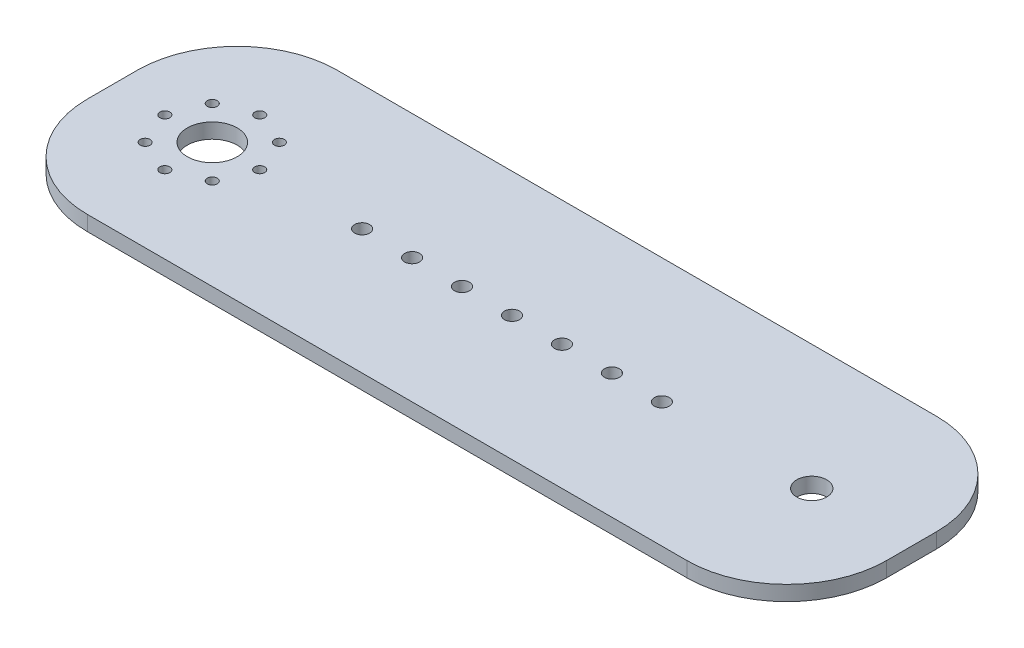
ISO-10303-21;
HEADER;
FILE_DESCRIPTION(('STEP AP214'),'2;1');
FILE_NAME('part.step','',(''),(''),'','','');
FILE_SCHEMA(('AUTOMOTIVE_DESIGN { 1 0 10303 214 1 1 1 1 }'));
ENDSEC;
DATA;
#1=APPLICATION_CONTEXT('core data for automotive mechanical design processes');
#2=APPLICATION_PROTOCOL_DEFINITION('international standard','automotive_design',2000,#1);
#3=PRODUCT_CONTEXT('',#1,'mechanical');
#4=PRODUCT('Part','Part','',(#3));
#5=PRODUCT_RELATED_PRODUCT_CATEGORY('part','',(#4));
#6=PRODUCT_DEFINITION_FORMATION('','',#4);
#7=PRODUCT_DEFINITION_CONTEXT('part definition',#1,'design');
#8=PRODUCT_DEFINITION('design','',#6,#7);
#9=PRODUCT_DEFINITION_SHAPE('','',#8);
#10=(LENGTH_UNIT() NAMED_UNIT(*) SI_UNIT(.MILLI.,.METRE.));
#11=(NAMED_UNIT(*) PLANE_ANGLE_UNIT() SI_UNIT($,.RADIAN.));
#12=(NAMED_UNIT(*) SI_UNIT($,.STERADIAN.) SOLID_ANGLE_UNIT());
#13=UNCERTAINTY_MEASURE_WITH_UNIT(LENGTH_MEASURE(1.E-05),#10,'distance_accuracy_value','');
#14=(GEOMETRIC_REPRESENTATION_CONTEXT(3) GLOBAL_UNCERTAINTY_ASSIGNED_CONTEXT((#13)) GLOBAL_UNIT_ASSIGNED_CONTEXT((#10,
#11,#12)) REPRESENTATION_CONTEXT('',''));
#15=CARTESIAN_POINT('',(0.,0.,0.));
#16=DIRECTION('',(0.,0.,1.));
#17=DIRECTION('',(1.,0.,0.));
#18=AXIS2_PLACEMENT_3D('',#15,#16,#17);
#19=CARTESIAN_POINT('',(80.,3.,-25.));
#20=DIRECTION('',(-1.,0.,0.));
#21=DIRECTION('',(0.,0.,1.));
#22=AXIS2_PLACEMENT_3D('',#19,#20,#21);
#23=PLANE('',#22);
#24=DIRECTION('',(0.,0.,-1.));
#25=VECTOR('',#24,1.);
#26=CARTESIAN_POINT('',(80.,0.,-25.));
#27=LINE('',#26,#25);
#28=CARTESIAN_POINT('',(80.,0.,5.));
#29=VERTEX_POINT('',#28);
#30=CARTESIAN_POINT('',(80.,0.,-5.));
#31=VERTEX_POINT('',#30);
#32=EDGE_CURVE('E136',#29,#31,#27,.T.);
#33=ORIENTED_EDGE('',*,*,#32,.T.);
#34=DIRECTION('',(0.,-1.,0.));
#35=VECTOR('',#34,1.);
#36=CARTESIAN_POINT('',(80.,3.,-5.));
#37=LINE('',#36,#35);
#38=CARTESIAN_POINT('',(80.,3.,-5.));
#39=VERTEX_POINT('',#38);
#40=EDGE_CURVE('E113',#31,#39,#37,.F.);
#41=ORIENTED_EDGE('',*,*,#40,.T.);
#42=DIRECTION('',(0.,0.,-1.));
#43=VECTOR('',#42,1.);
#44=CARTESIAN_POINT('',(80.,3.,-25.));
#45=LINE('',#44,#43);
#46=CARTESIAN_POINT('',(80.,3.,5.));
#47=VERTEX_POINT('',#46);
#48=EDGE_CURVE('E146',#47,#39,#45,.T.);
#49=ORIENTED_EDGE('',*,*,#48,.F.);
#50=DIRECTION('',(0.,-1.,0.));
#51=VECTOR('',#50,1.);
#52=CARTESIAN_POINT('',(80.,3.,5.));
#53=LINE('',#52,#51);
#54=EDGE_CURVE('E118',#47,#29,#53,.T.);
#55=ORIENTED_EDGE('',*,*,#54,.T.);
#56=EDGE_LOOP('',(#33,#41,#49,#55));
#57=FACE_BOUND('',#56,.T.);
#58=ADVANCED_FACE('F41',(#57),#23,.F.);
#59=CARTESIAN_POINT('',(-80.,3.,-25.));
#60=DIRECTION('',(0.,0.,1.));
#61=DIRECTION('',(1.,0.,0.));
#62=AXIS2_PLACEMENT_3D('',#59,#60,#61);
#63=PLANE('',#62);
#64=DIRECTION('',(-1.,0.,0.));
#65=VECTOR('',#64,1.);
#66=CARTESIAN_POINT('',(-80.,3.,-25.));
#67=LINE('',#66,#65);
#68=CARTESIAN_POINT('',(60.,3.,-25.));
#69=VERTEX_POINT('',#68);
#70=CARTESIAN_POINT('',(-60.,3.,-25.));
#71=VERTEX_POINT('',#70);
#72=EDGE_CURVE('E128',#69,#71,#67,.T.);
#73=ORIENTED_EDGE('',*,*,#72,.F.);
#74=DIRECTION('',(0.,-1.,0.));
#75=VECTOR('',#74,1.);
#76=CARTESIAN_POINT('',(60.,3.,-25.));
#77=LINE('',#76,#75);
#78=CARTESIAN_POINT('',(60.,0.,-25.));
#79=VERTEX_POINT('',#78);
#80=EDGE_CURVE('E112',#69,#79,#77,.T.);
#81=ORIENTED_EDGE('',*,*,#80,.T.);
#82=DIRECTION('',(-1.,0.,0.));
#83=VECTOR('',#82,1.);
#84=CARTESIAN_POINT('',(-80.,0.,-25.));
#85=LINE('',#84,#83);
#86=CARTESIAN_POINT('',(-60.,0.,-25.));
#87=VERTEX_POINT('',#86);
#88=EDGE_CURVE('E125',#79,#87,#85,.T.);
#89=ORIENTED_EDGE('',*,*,#88,.T.);
#90=DIRECTION('',(0.,-1.,0.));
#91=VECTOR('',#90,1.);
#92=CARTESIAN_POINT('',(-60.,3.,-25.));
#93=LINE('',#92,#91);
#94=EDGE_CURVE('E130',#87,#71,#93,.F.);
#95=ORIENTED_EDGE('',*,*,#94,.T.);
#96=EDGE_LOOP('',(#73,#81,#89,#95));
#97=FACE_BOUND('',#96,.T.);
#98=ADVANCED_FACE('F124',(#97),#63,.F.);
#99=CARTESIAN_POINT('',(-80.,3.,-25.));
#100=DIRECTION('',(1.,0.,0.));
#101=DIRECTION('',(0.,0.,-1.));
#102=AXIS2_PLACEMENT_3D('',#99,#100,#101);
#103=PLANE('',#102);
#104=DIRECTION('',(0.,0.,1.));
#105=VECTOR('',#104,1.);
#106=CARTESIAN_POINT('',(-80.,3.,-25.));
#107=LINE('',#106,#105);
#108=CARTESIAN_POINT('',(-80.,3.,-5.));
#109=VERTEX_POINT('',#108);
#110=CARTESIAN_POINT('',(-80.,3.,5.));
#111=VERTEX_POINT('',#110);
#112=EDGE_CURVE('E169',#109,#111,#107,.T.);
#113=ORIENTED_EDGE('',*,*,#112,.F.);
#114=DIRECTION('',(0.,-1.,0.));
#115=VECTOR('',#114,1.);
#116=CARTESIAN_POINT('',(-80.,3.,-5.));
#117=LINE('',#116,#115);
#118=CARTESIAN_POINT('',(-80.,0.,-5.));
#119=VERTEX_POINT('',#118);
#120=EDGE_CURVE('E11',#109,#119,#117,.T.);
#121=ORIENTED_EDGE('',*,*,#120,.T.);
#122=DIRECTION('',(0.,0.,1.));
#123=VECTOR('',#122,1.);
#124=CARTESIAN_POINT('',(-80.,0.,-25.));
#125=LINE('',#124,#123);
#126=CARTESIAN_POINT('',(-80.,0.,5.));
#127=VERTEX_POINT('',#126);
#128=EDGE_CURVE('E135',#119,#127,#125,.T.);
#129=ORIENTED_EDGE('',*,*,#128,.T.);
#130=DIRECTION('',(0.,-1.,0.));
#131=VECTOR('',#130,1.);
#132=CARTESIAN_POINT('',(-80.,3.,5.));
#133=LINE('',#132,#131);
#134=EDGE_CURVE('E49',#127,#111,#133,.F.);
#135=ORIENTED_EDGE('',*,*,#134,.T.);
#136=EDGE_LOOP('',(#113,#121,#129,#135));
#137=FACE_BOUND('',#136,.T.);
#138=ADVANCED_FACE('F168',(#137),#103,.F.);
#139=CARTESIAN_POINT('',(-80.,3.,25.));
#140=DIRECTION('',(0.,0.,-1.));
#141=DIRECTION('',(-1.,0.,0.));
#142=AXIS2_PLACEMENT_3D('',#139,#140,#141);
#143=PLANE('',#142);
#144=DIRECTION('',(1.,0.,0.));
#145=VECTOR('',#144,1.);
#146=CARTESIAN_POINT('',(-80.,0.,25.));
#147=LINE('',#146,#145);
#148=CARTESIAN_POINT('',(-60.,0.,25.));
#149=VERTEX_POINT('',#148);
#150=CARTESIAN_POINT('',(60.,0.,25.));
#151=VERTEX_POINT('',#150);
#152=EDGE_CURVE('E139',#149,#151,#147,.T.);
#153=ORIENTED_EDGE('',*,*,#152,.T.);
#154=DIRECTION('',(0.,-1.,0.));
#155=VECTOR('',#154,1.);
#156=CARTESIAN_POINT('',(60.,3.,25.));
#157=LINE('',#156,#155);
#158=CARTESIAN_POINT('',(60.,3.,25.));
#159=VERTEX_POINT('',#158);
#160=EDGE_CURVE('E56',#151,#159,#157,.F.);
#161=ORIENTED_EDGE('',*,*,#160,.T.);
#162=DIRECTION('',(1.,0.,0.));
#163=VECTOR('',#162,1.);
#164=CARTESIAN_POINT('',(-80.,3.,25.));
#165=LINE('',#164,#163);
#166=CARTESIAN_POINT('',(-60.,3.,25.));
#167=VERTEX_POINT('',#166);
#168=EDGE_CURVE('E147',#167,#159,#165,.T.);
#169=ORIENTED_EDGE('',*,*,#168,.F.);
#170=DIRECTION('',(0.,-1.,0.));
#171=VECTOR('',#170,1.);
#172=CARTESIAN_POINT('',(-60.,3.,25.));
#173=LINE('',#172,#171);
#174=EDGE_CURVE('E162',#167,#149,#173,.T.);
#175=ORIENTED_EDGE('',*,*,#174,.T.);
#176=EDGE_LOOP('',(#153,#161,#169,#175));
#177=FACE_BOUND('',#176,.T.);
#178=ADVANCED_FACE('F178',(#177),#143,.F.);
#179=CARTESIAN_POINT('',(0.,3.,0.));
#180=DIRECTION('',(0.,1.,0.));
#181=DIRECTION('',(0.,0.,1.));
#182=AXIS2_PLACEMENT_3D('',#179,#180,#181);
#183=PLANE('',#182);
#184=CARTESIAN_POINT('',(-30.,3.,0.));
#185=DIRECTION('',(0.,1.,0.));
#186=DIRECTION('',(0.,0.,1.));
#187=AXIS2_PLACEMENT_3D('',#184,#185,#186);
#188=CIRCLE('',#187,1.5);
#189=CARTESIAN_POINT('',(-30.,3.,1.5));
#190=VERTEX_POINT('',#189);
#191=EDGE_CURVE('E260',#190,#190,#188,.T.);
#192=ORIENTED_EDGE('',*,*,#191,.F.);
#193=EDGE_LOOP('',(#192));
#194=FACE_BOUND('',#193,.T.);
#195=CARTESIAN_POINT('',(-20.,3.,0.));
#196=DIRECTION('',(0.,1.,0.));
#197=DIRECTION('',(0.,0.,1.));
#198=AXIS2_PLACEMENT_3D('',#195,#196,#197);
#199=CIRCLE('',#198,1.5);
#200=CARTESIAN_POINT('',(-20.,3.,1.5));
#201=VERTEX_POINT('',#200);
#202=EDGE_CURVE('E267',#201,#201,#199,.T.);
#203=ORIENTED_EDGE('',*,*,#202,.F.);
#204=EDGE_LOOP('',(#203));
#205=FACE_BOUND('',#204,.T.);
#206=CARTESIAN_POINT('',(-10.,3.,0.));
#207=DIRECTION('',(0.,1.,0.));
#208=DIRECTION('',(0.,0.,1.));
#209=AXIS2_PLACEMENT_3D('',#206,#207,#208);
#210=CIRCLE('',#209,1.5);
#211=CARTESIAN_POINT('',(-10.,3.,1.5));
#212=VERTEX_POINT('',#211);
#213=EDGE_CURVE('E273',#212,#212,#210,.T.);
#214=ORIENTED_EDGE('',*,*,#213,.F.);
#215=EDGE_LOOP('',(#214));
#216=FACE_BOUND('',#215,.T.);
#217=CARTESIAN_POINT('',(30.,3.,0.));
#218=DIRECTION('',(0.,1.,0.));
#219=DIRECTION('',(0.,0.,1.));
#220=AXIS2_PLACEMENT_3D('',#217,#218,#219);
#221=CIRCLE('',#220,1.5);
#222=CARTESIAN_POINT('',(30.,3.,1.5));
#223=VERTEX_POINT('',#222);
#224=EDGE_CURVE('E279',#223,#223,#221,.T.);
#225=ORIENTED_EDGE('',*,*,#224,.F.);
#226=EDGE_LOOP('',(#225));
#227=FACE_BOUND('',#226,.T.);
#228=CARTESIAN_POINT('',(20.,3.,0.));
#229=DIRECTION('',(0.,1.,0.));
#230=DIRECTION('',(0.,0.,1.));
#231=AXIS2_PLACEMENT_3D('',#228,#229,#230);
#232=CIRCLE('',#231,1.5);
#233=CARTESIAN_POINT('',(20.,3.,1.5));
#234=VERTEX_POINT('',#233);
#235=EDGE_CURVE('E259',#234,#234,#232,.T.);
#236=ORIENTED_EDGE('',*,*,#235,.F.);
#237=EDGE_LOOP('',(#236));
#238=FACE_BOUND('',#237,.T.);
#239=CARTESIAN_POINT('',(10.,3.,0.));
#240=DIRECTION('',(0.,1.,0.));
#241=DIRECTION('',(0.,0.,1.));
#242=AXIS2_PLACEMENT_3D('',#239,#240,#241);
#243=CIRCLE('',#242,1.5);
#244=CARTESIAN_POINT('',(10.,3.,1.5));
#245=VERTEX_POINT('',#244);
#246=EDGE_CURVE('E251',#245,#245,#243,.T.);
#247=ORIENTED_EDGE('',*,*,#246,.F.);
#248=EDGE_LOOP('',(#247));
#249=FACE_BOUND('',#248,.T.);
#250=CARTESIAN_POINT('',(0.,3.,0.));
#251=DIRECTION('',(0.,1.,0.));
#252=DIRECTION('',(0.,0.,1.));
#253=AXIS2_PLACEMENT_3D('',#250,#251,#252);
#254=CIRCLE('',#253,1.5);
#255=CARTESIAN_POINT('',(0.,3.,1.5));
#256=VERTEX_POINT('',#255);
#257=EDGE_CURVE('E248',#256,#256,#254,.T.);
#258=ORIENTED_EDGE('',*,*,#257,.F.);
#259=EDGE_LOOP('',(#258));
#260=FACE_BOUND('',#259,.T.);
#261=CARTESIAN_POINT('',(60.,3.,0.));
#262=DIRECTION('',(0.,1.,0.));
#263=DIRECTION('',(0.,0.,1.));
#264=AXIS2_PLACEMENT_3D('',#261,#262,#263);
#265=CIRCLE('',#264,3.00000000000001);
#266=CARTESIAN_POINT('',(60.,3.,3.00000000000001));
#267=VERTEX_POINT('',#266);
#268=EDGE_CURVE('E242',#267,#267,#265,.T.);
#269=ORIENTED_EDGE('',*,*,#268,.F.);
#270=EDGE_LOOP('',(#269));
#271=FACE_BOUND('',#270,.T.);
#272=CARTESIAN_POINT('',(-60.,3.,-9.5));
#273=DIRECTION('',(0.,1.,0.));
#274=DIRECTION('',(1.,0.,0.));
#275=AXIS2_PLACEMENT_3D('',#272,#273,#274);
#276=CIRCLE('',#275,0.999999999999998);
#277=CARTESIAN_POINT('',(-59.,3.,-9.50000000000001));
#278=VERTEX_POINT('',#277);
#279=EDGE_CURVE('E225',#278,#278,#276,.T.);
#280=ORIENTED_EDGE('',*,*,#279,.F.);
#281=EDGE_LOOP('',(#280));
#282=FACE_BOUND('',#281,.T.);
#283=CARTESIAN_POINT('',(-66.7175144212722,3.,-6.71751442127217));
#284=DIRECTION('',(0.,1.,0.));
#285=DIRECTION('',(0.707106781186544,0.,-0.707106781186551));
#286=AXIS2_PLACEMENT_3D('',#283,#284,#285);
#287=CIRCLE('',#286,0.999999999999998);
#288=CARTESIAN_POINT('',(-66.0104076400857,3.,-7.42462120245872));
#289=VERTEX_POINT('',#288);
#290=EDGE_CURVE('E219',#289,#289,#287,.T.);
#291=ORIENTED_EDGE('',*,*,#290,.F.);
#292=EDGE_LOOP('',(#291));
#293=FACE_BOUND('',#292,.T.);
#294=CARTESIAN_POINT('',(-69.5,3.,0.));
#295=DIRECTION('',(0.,1.,0.));
#296=DIRECTION('',(0.,0.,-1.));
#297=AXIS2_PLACEMENT_3D('',#294,#295,#296);
#298=CIRCLE('',#297,0.999999999999998);
#299=CARTESIAN_POINT('',(-69.5,3.,-0.999999999999998));
#300=VERTEX_POINT('',#299);
#301=EDGE_CURVE('E213',#300,#300,#298,.T.);
#302=ORIENTED_EDGE('',*,*,#301,.F.);
#303=EDGE_LOOP('',(#302));
#304=FACE_BOUND('',#303,.T.);
#305=CARTESIAN_POINT('',(-66.7175144212722,3.,6.71751442127226));
#306=DIRECTION('',(0.,1.,0.));
#307=DIRECTION('',(-0.707106781186554,0.,-0.707106781186541));
#308=AXIS2_PLACEMENT_3D('',#305,#306,#307);
#309=CIRCLE('',#308,0.999999999999998);
#310=CARTESIAN_POINT('',(-67.4246212024587,3.,6.01040764008572));
#311=VERTEX_POINT('',#310);
#312=EDGE_CURVE('E206',#311,#311,#309,.T.);
#313=ORIENTED_EDGE('',*,*,#312,.F.);
#314=EDGE_LOOP('',(#313));
#315=FACE_BOUND('',#314,.T.);
#316=CARTESIAN_POINT('',(-59.9999999999999,3.,9.5));
#317=DIRECTION('',(0.,1.,0.));
#318=DIRECTION('',(-1.,0.,0.));
#319=AXIS2_PLACEMENT_3D('',#316,#317,#318);
#320=CIRCLE('',#319,0.999999999999998);
#321=CARTESIAN_POINT('',(-60.9999999999999,3.,9.50000000000001));
#322=VERTEX_POINT('',#321);
#323=EDGE_CURVE('E237',#322,#322,#320,.T.);
#324=ORIENTED_EDGE('',*,*,#323,.F.);
#325=EDGE_LOOP('',(#324));
#326=FACE_BOUND('',#325,.T.);
#327=CARTESIAN_POINT('',(-53.2824855787277,3.,6.71751442127212));
#328=DIRECTION('',(0.,1.,0.));
#329=DIRECTION('',(-0.707106781186539,0.,0.707106781186556));
#330=AXIS2_PLACEMENT_3D('',#327,#328,#329);
#331=CIRCLE('',#330,0.999999999999998);
#332=CARTESIAN_POINT('',(-53.9895923599143,3.,7.42462120245867));
#333=VERTEX_POINT('',#332);
#334=EDGE_CURVE('E230',#333,#333,#331,.T.);
#335=ORIENTED_EDGE('',*,*,#334,.F.);
#336=EDGE_LOOP('',(#335));
#337=FACE_BOUND('',#336,.T.);
#338=CARTESIAN_POINT('',(-53.2824855787278,3.,-6.71751442127221));
#339=DIRECTION('',(0.,1.,0.));
#340=DIRECTION('',(0.707106781186549,0.,0.707106781186546));
#341=AXIS2_PLACEMENT_3D('',#338,#339,#340);
#342=CIRCLE('',#341,0.999999999999998);
#343=CARTESIAN_POINT('',(-52.5753787975413,3.,-6.01040764008567));
#344=VERTEX_POINT('',#343);
#345=EDGE_CURVE('E200',#344,#344,#342,.T.);
#346=ORIENTED_EDGE('',*,*,#345,.F.);
#347=EDGE_LOOP('',(#346));
#348=FACE_BOUND('',#347,.T.);
#349=CARTESIAN_POINT('',(-50.5,3.,0.));
#350=DIRECTION('',(0.,1.,0.));
#351=DIRECTION('',(0.,0.,1.));
#352=AXIS2_PLACEMENT_3D('',#349,#350,#351);
#353=CIRCLE('',#352,0.999999999999998);
#354=CARTESIAN_POINT('',(-50.5,3.,0.999999999999998));
#355=VERTEX_POINT('',#354);
#356=EDGE_CURVE('E194',#355,#355,#353,.T.);
#357=ORIENTED_EDGE('',*,*,#356,.F.);
#358=EDGE_LOOP('',(#357));
#359=FACE_BOUND('',#358,.T.);
#360=CARTESIAN_POINT('',(-60.,3.,0.));
#361=DIRECTION('',(0.,1.,0.));
#362=DIRECTION('',(0.,0.,1.));
#363=AXIS2_PLACEMENT_3D('',#360,#361,#362);
#364=CIRCLE('',#363,5.);
#365=CARTESIAN_POINT('',(-60.,3.,5.));
#366=VERTEX_POINT('',#365);
#367=EDGE_CURVE('E188',#366,#366,#364,.T.);
#368=ORIENTED_EDGE('',*,*,#367,.F.);
#369=EDGE_LOOP('',(#368));
#370=FACE_BOUND('',#369,.T.);
#371=ORIENTED_EDGE('',*,*,#48,.T.);
#372=CARTESIAN_POINT('',(60.,3.,-5.));
#373=DIRECTION('',(0.,1.,0.));
#374=DIRECTION('',(0.,0.,1.));
#375=AXIS2_PLACEMENT_3D('',#372,#373,#374);
#376=CIRCLE('',#375,20.);
#377=EDGE_CURVE('E160',#39,#69,#376,.T.);
#378=ORIENTED_EDGE('',*,*,#377,.T.);
#379=ORIENTED_EDGE('',*,*,#72,.T.);
#380=CARTESIAN_POINT('',(-60.,3.,-5.));
#381=DIRECTION('',(0.,1.,0.));
#382=DIRECTION('',(0.,0.,1.));
#383=AXIS2_PLACEMENT_3D('',#380,#381,#382);
#384=CIRCLE('',#383,20.);
#385=EDGE_CURVE('E156',#71,#109,#384,.T.);
#386=ORIENTED_EDGE('',*,*,#385,.T.);
#387=ORIENTED_EDGE('',*,*,#112,.T.);
#388=CARTESIAN_POINT('',(-60.,3.,5.));
#389=DIRECTION('',(0.,1.,0.));
#390=DIRECTION('',(0.,0.,1.));
#391=AXIS2_PLACEMENT_3D('',#388,#389,#390);
#392=CIRCLE('',#391,20.);
#393=EDGE_CURVE('E63',#111,#167,#392,.T.);
#394=ORIENTED_EDGE('',*,*,#393,.T.);
#395=ORIENTED_EDGE('',*,*,#168,.T.);
#396=CARTESIAN_POINT('',(60.,3.,5.));
#397=DIRECTION('',(0.,1.,0.));
#398=DIRECTION('',(0.,0.,1.));
#399=AXIS2_PLACEMENT_3D('',#396,#397,#398);
#400=CIRCLE('',#399,20.);
#401=EDGE_CURVE('E158',#159,#47,#400,.T.);
#402=ORIENTED_EDGE('',*,*,#401,.T.);
#403=EDGE_LOOP('',(#371,#378,#379,#386,#387,#394,#395,#402));
#404=FACE_BOUND('',#403,.T.);
#405=ADVANCED_FACE('F173',(#194,#205,#216,#227,#238,#249,#260,#271,#282,#293,#304,#315,#326,
#337,#348,#359,#370,#404),#183,.T.);
#406=CARTESIAN_POINT('',(0.,0.,0.));
#407=DIRECTION('',(0.,1.,0.));
#408=DIRECTION('',(0.,0.,1.));
#409=AXIS2_PLACEMENT_3D('',#406,#407,#408);
#410=PLANE('',#409);
#411=CARTESIAN_POINT('',(-30.,0.,0.));
#412=DIRECTION('',(0.,1.,0.));
#413=DIRECTION('',(0.,0.,1.));
#414=AXIS2_PLACEMENT_3D('',#411,#412,#413);
#415=CIRCLE('',#414,1.5);
#416=CARTESIAN_POINT('',(-30.,0.,1.5));
#417=VERTEX_POINT('',#416);
#418=EDGE_CURVE('E264',#417,#417,#415,.T.);
#419=ORIENTED_EDGE('',*,*,#418,.T.);
#420=EDGE_LOOP('',(#419));
#421=FACE_BOUND('',#420,.T.);
#422=CARTESIAN_POINT('',(-20.,0.,0.));
#423=DIRECTION('',(0.,1.,0.));
#424=DIRECTION('',(0.,0.,1.));
#425=AXIS2_PLACEMENT_3D('',#422,#423,#424);
#426=CIRCLE('',#425,1.5);
#427=CARTESIAN_POINT('',(-20.,0.,1.5));
#428=VERTEX_POINT('',#427);
#429=EDGE_CURVE('E263',#428,#428,#426,.T.);
#430=ORIENTED_EDGE('',*,*,#429,.T.);
#431=EDGE_LOOP('',(#430));
#432=FACE_BOUND('',#431,.T.);
#433=CARTESIAN_POINT('',(-10.,0.,0.));
#434=DIRECTION('',(0.,1.,0.));
#435=DIRECTION('',(0.,0.,1.));
#436=AXIS2_PLACEMENT_3D('',#433,#434,#435);
#437=CIRCLE('',#436,1.5);
#438=CARTESIAN_POINT('',(-10.,0.,1.5));
#439=VERTEX_POINT('',#438);
#440=EDGE_CURVE('E270',#439,#439,#437,.T.);
#441=ORIENTED_EDGE('',*,*,#440,.T.);
#442=EDGE_LOOP('',(#441));
#443=FACE_BOUND('',#442,.T.);
#444=CARTESIAN_POINT('',(30.,0.,0.));
#445=DIRECTION('',(0.,1.,0.));
#446=DIRECTION('',(0.,0.,1.));
#447=AXIS2_PLACEMENT_3D('',#444,#445,#446);
#448=CIRCLE('',#447,1.5);
#449=CARTESIAN_POINT('',(30.,0.,1.5));
#450=VERTEX_POINT('',#449);
#451=EDGE_CURVE('E276',#450,#450,#448,.T.);
#452=ORIENTED_EDGE('',*,*,#451,.T.);
#453=EDGE_LOOP('',(#452));
#454=FACE_BOUND('',#453,.T.);
#455=CARTESIAN_POINT('',(20.,0.,0.));
#456=DIRECTION('',(0.,1.,0.));
#457=DIRECTION('',(0.,0.,1.));
#458=AXIS2_PLACEMENT_3D('',#455,#456,#457);
#459=CIRCLE('',#458,1.5);
#460=CARTESIAN_POINT('',(20.,0.,1.5));
#461=VERTEX_POINT('',#460);
#462=EDGE_CURVE('E282',#461,#461,#459,.T.);
#463=ORIENTED_EDGE('',*,*,#462,.T.);
#464=EDGE_LOOP('',(#463));
#465=FACE_BOUND('',#464,.T.);
#466=CARTESIAN_POINT('',(10.,0.,0.));
#467=DIRECTION('',(0.,1.,0.));
#468=DIRECTION('',(0.,0.,1.));
#469=AXIS2_PLACEMENT_3D('',#466,#467,#468);
#470=CIRCLE('',#469,1.5);
#471=CARTESIAN_POINT('',(10.,0.,1.5));
#472=VERTEX_POINT('',#471);
#473=EDGE_CURVE('E256',#472,#472,#470,.T.);
#474=ORIENTED_EDGE('',*,*,#473,.T.);
#475=EDGE_LOOP('',(#474));
#476=FACE_BOUND('',#475,.T.);
#477=CARTESIAN_POINT('',(0.,0.,0.));
#478=DIRECTION('',(0.,1.,0.));
#479=DIRECTION('',(0.,0.,1.));
#480=AXIS2_PLACEMENT_3D('',#477,#478,#479);
#481=CIRCLE('',#480,1.5);
#482=CARTESIAN_POINT('',(0.,0.,1.5));
#483=VERTEX_POINT('',#482);
#484=EDGE_CURVE('E245',#483,#483,#481,.T.);
#485=ORIENTED_EDGE('',*,*,#484,.T.);
#486=EDGE_LOOP('',(#485));
#487=FACE_BOUND('',#486,.T.);
#488=CARTESIAN_POINT('',(60.,0.,0.));
#489=DIRECTION('',(0.,1.,0.));
#490=DIRECTION('',(0.,0.,1.));
#491=AXIS2_PLACEMENT_3D('',#488,#489,#490);
#492=CIRCLE('',#491,3.00000000000001);
#493=CARTESIAN_POINT('',(60.,0.,3.00000000000001));
#494=VERTEX_POINT('',#493);
#495=EDGE_CURVE('E234',#494,#494,#492,.T.);
#496=ORIENTED_EDGE('',*,*,#495,.T.);
#497=EDGE_LOOP('',(#496));
#498=FACE_BOUND('',#497,.T.);
#499=CARTESIAN_POINT('',(-60.,0.,-9.5));
#500=DIRECTION('',(0.,1.,0.));
#501=DIRECTION('',(1.,0.,0.));
#502=AXIS2_PLACEMENT_3D('',#499,#500,#501);
#503=CIRCLE('',#502,0.999999999999998);
#504=CARTESIAN_POINT('',(-59.,0.,-9.50000000000001));
#505=VERTEX_POINT('',#504);
#506=EDGE_CURVE('E203',#505,#505,#503,.T.);
#507=ORIENTED_EDGE('',*,*,#506,.T.);
#508=EDGE_LOOP('',(#507));
#509=FACE_BOUND('',#508,.T.);
#510=CARTESIAN_POINT('',(-66.7175144212722,0.,-6.71751442127217));
#511=DIRECTION('',(0.,1.,0.));
#512=DIRECTION('',(0.707106781186544,0.,-0.707106781186551));
#513=AXIS2_PLACEMENT_3D('',#510,#511,#512);
#514=CIRCLE('',#513,0.999999999999998);
#515=CARTESIAN_POINT('',(-66.0104076400857,0.,-7.42462120245872));
#516=VERTEX_POINT('',#515);
#517=EDGE_CURVE('E222',#516,#516,#514,.T.);
#518=ORIENTED_EDGE('',*,*,#517,.T.);
#519=EDGE_LOOP('',(#518));
#520=FACE_BOUND('',#519,.T.);
#521=CARTESIAN_POINT('',(-69.5,0.,0.));
#522=DIRECTION('',(0.,1.,0.));
#523=DIRECTION('',(0.,0.,-1.));
#524=AXIS2_PLACEMENT_3D('',#521,#522,#523);
#525=CIRCLE('',#524,0.999999999999998);
#526=CARTESIAN_POINT('',(-69.5,0.,-0.999999999999998));
#527=VERTEX_POINT('',#526);
#528=EDGE_CURVE('E216',#527,#527,#525,.T.);
#529=ORIENTED_EDGE('',*,*,#528,.T.);
#530=EDGE_LOOP('',(#529));
#531=FACE_BOUND('',#530,.T.);
#532=CARTESIAN_POINT('',(-66.7175144212722,0.,6.71751442127226));
#533=DIRECTION('',(0.,1.,0.));
#534=DIRECTION('',(-0.707106781186554,0.,-0.707106781186541));
#535=AXIS2_PLACEMENT_3D('',#532,#533,#534);
#536=CIRCLE('',#535,0.999999999999998);
#537=CARTESIAN_POINT('',(-67.4246212024587,0.,6.01040764008572));
#538=VERTEX_POINT('',#537);
#539=EDGE_CURVE('E209',#538,#538,#536,.T.);
#540=ORIENTED_EDGE('',*,*,#539,.T.);
#541=EDGE_LOOP('',(#540));
#542=FACE_BOUND('',#541,.T.);
#543=CARTESIAN_POINT('',(-59.9999999999999,0.,9.5));
#544=DIRECTION('',(0.,1.,0.));
#545=DIRECTION('',(-1.,0.,0.));
#546=AXIS2_PLACEMENT_3D('',#543,#544,#545);
#547=CIRCLE('',#546,0.999999999999998);
#548=CARTESIAN_POINT('',(-60.9999999999999,0.,9.50000000000001));
#549=VERTEX_POINT('',#548);
#550=EDGE_CURVE('E210',#549,#549,#547,.T.);
#551=ORIENTED_EDGE('',*,*,#550,.T.);
#552=EDGE_LOOP('',(#551));
#553=FACE_BOUND('',#552,.T.);
#554=CARTESIAN_POINT('',(-53.2824855787277,0.,6.71751442127212));
#555=DIRECTION('',(0.,1.,0.));
#556=DIRECTION('',(-0.707106781186539,0.,0.707106781186556));
#557=AXIS2_PLACEMENT_3D('',#554,#555,#556);
#558=CIRCLE('',#557,0.999999999999998);
#559=CARTESIAN_POINT('',(-53.9895923599143,0.,7.42462120245867));
#560=VERTEX_POINT('',#559);
#561=EDGE_CURVE('E233',#560,#560,#558,.T.);
#562=ORIENTED_EDGE('',*,*,#561,.T.);
#563=EDGE_LOOP('',(#562));
#564=FACE_BOUND('',#563,.T.);
#565=CARTESIAN_POINT('',(-53.2824855787278,0.,-6.71751442127221));
#566=DIRECTION('',(0.,1.,0.));
#567=DIRECTION('',(0.707106781186549,0.,0.707106781186546));
#568=AXIS2_PLACEMENT_3D('',#565,#566,#567);
#569=CIRCLE('',#568,0.999999999999998);
#570=CARTESIAN_POINT('',(-52.5753787975413,0.,-6.01040764008567));
#571=VERTEX_POINT('',#570);
#572=EDGE_CURVE('E197',#571,#571,#569,.T.);
#573=ORIENTED_EDGE('',*,*,#572,.T.);
#574=EDGE_LOOP('',(#573));
#575=FACE_BOUND('',#574,.T.);
#576=CARTESIAN_POINT('',(-50.5,0.,0.));
#577=DIRECTION('',(0.,1.,0.));
#578=DIRECTION('',(0.,0.,1.));
#579=AXIS2_PLACEMENT_3D('',#576,#577,#578);
#580=CIRCLE('',#579,0.999999999999998);
#581=CARTESIAN_POINT('',(-50.5,0.,0.999999999999998));
#582=VERTEX_POINT('',#581);
#583=EDGE_CURVE('E191',#582,#582,#580,.T.);
#584=ORIENTED_EDGE('',*,*,#583,.T.);
#585=EDGE_LOOP('',(#584));
#586=FACE_BOUND('',#585,.T.);
#587=CARTESIAN_POINT('',(-60.,0.,0.));
#588=DIRECTION('',(0.,1.,0.));
#589=DIRECTION('',(0.,0.,1.));
#590=AXIS2_PLACEMENT_3D('',#587,#588,#589);
#591=CIRCLE('',#590,5.);
#592=CARTESIAN_POINT('',(-60.,0.,5.));
#593=VERTEX_POINT('',#592);
#594=EDGE_CURVE('E141',#593,#593,#591,.T.);
#595=ORIENTED_EDGE('',*,*,#594,.T.);
#596=EDGE_LOOP('',(#595));
#597=FACE_BOUND('',#596,.T.);
#598=ORIENTED_EDGE('',*,*,#88,.F.);
#599=CARTESIAN_POINT('',(60.,0.,-5.));
#600=DIRECTION('',(0.,1.,0.));
#601=DIRECTION('',(0.,0.,1.));
#602=AXIS2_PLACEMENT_3D('',#599,#600,#601);
#603=CIRCLE('',#602,20.);
#604=EDGE_CURVE('E108',#79,#31,#603,.F.);
#605=ORIENTED_EDGE('',*,*,#604,.T.);
#606=ORIENTED_EDGE('',*,*,#32,.F.);
#607=CARTESIAN_POINT('',(60.,0.,5.));
#608=DIRECTION('',(0.,1.,0.));
#609=DIRECTION('',(0.,0.,1.));
#610=AXIS2_PLACEMENT_3D('',#607,#608,#609);
#611=CIRCLE('',#610,20.);
#612=EDGE_CURVE('E119',#29,#151,#611,.F.);
#613=ORIENTED_EDGE('',*,*,#612,.T.);
#614=ORIENTED_EDGE('',*,*,#152,.F.);
#615=CARTESIAN_POINT('',(-60.,0.,5.));
#616=DIRECTION('',(0.,1.,0.));
#617=DIRECTION('',(0.,0.,1.));
#618=AXIS2_PLACEMENT_3D('',#615,#616,#617);
#619=CIRCLE('',#618,20.);
#620=EDGE_CURVE('E129',#149,#127,#619,.F.);
#621=ORIENTED_EDGE('',*,*,#620,.T.);
#622=ORIENTED_EDGE('',*,*,#128,.F.);
#623=CARTESIAN_POINT('',(-60.,0.,-5.));
#624=DIRECTION('',(0.,1.,0.));
#625=DIRECTION('',(0.,0.,1.));
#626=AXIS2_PLACEMENT_3D('',#623,#624,#625);
#627=CIRCLE('',#626,20.);
#628=EDGE_CURVE('E134',#119,#87,#627,.F.);
#629=ORIENTED_EDGE('',*,*,#628,.T.);
#630=EDGE_LOOP('',(#598,#605,#606,#613,#614,#621,#622,#629));
#631=FACE_BOUND('',#630,.T.);
#632=ADVANCED_FACE('F132',(#421,#432,#443,#454,#465,#476,#487,#498,#509,#520,#531,#542,#553,
#564,#575,#586,#597,#631),#410,.F.);
#633=CARTESIAN_POINT('',(60.,3.,-5.));
#634=DIRECTION('',(0.,-1.,0.));
#635=DIRECTION('',(0.,0.,-1.));
#636=AXIS2_PLACEMENT_3D('',#633,#634,#635);
#637=CYLINDRICAL_SURFACE('',#636,20.);
#638=ORIENTED_EDGE('',*,*,#377,.F.);
#639=ORIENTED_EDGE('',*,*,#40,.F.);
#640=ORIENTED_EDGE('',*,*,#604,.F.);
#641=ORIENTED_EDGE('',*,*,#80,.F.);
#642=EDGE_LOOP('',(#638,#639,#640,#641));
#643=FACE_BOUND('',#642,.T.);
#644=ADVANCED_FACE('F111',(#643),#637,.T.);
#645=CARTESIAN_POINT('',(60.,3.,5.));
#646=DIRECTION('',(0.,-1.,0.));
#647=DIRECTION('',(0.,0.,-1.));
#648=AXIS2_PLACEMENT_3D('',#645,#646,#647);
#649=CYLINDRICAL_SURFACE('',#648,20.);
#650=ORIENTED_EDGE('',*,*,#401,.F.);
#651=ORIENTED_EDGE('',*,*,#160,.F.);
#652=ORIENTED_EDGE('',*,*,#612,.F.);
#653=ORIENTED_EDGE('',*,*,#54,.F.);
#654=EDGE_LOOP('',(#650,#651,#652,#653));
#655=FACE_BOUND('',#654,.T.);
#656=ADVANCED_FACE('F182',(#655),#649,.T.);
#657=CARTESIAN_POINT('',(-60.,3.,-5.));
#658=DIRECTION('',(0.,-1.,0.));
#659=DIRECTION('',(0.,0.,-1.));
#660=AXIS2_PLACEMENT_3D('',#657,#658,#659);
#661=CYLINDRICAL_SURFACE('',#660,20.);
#662=ORIENTED_EDGE('',*,*,#385,.F.);
#663=ORIENTED_EDGE('',*,*,#94,.F.);
#664=ORIENTED_EDGE('',*,*,#628,.F.);
#665=ORIENTED_EDGE('',*,*,#120,.F.);
#666=EDGE_LOOP('',(#662,#663,#664,#665));
#667=FACE_BOUND('',#666,.T.);
#668=ADVANCED_FACE('F340',(#667),#661,.T.);
#669=CARTESIAN_POINT('',(-60.,3.,5.));
#670=DIRECTION('',(0.,-1.,0.));
#671=DIRECTION('',(0.,0.,-1.));
#672=AXIS2_PLACEMENT_3D('',#669,#670,#671);
#673=CYLINDRICAL_SURFACE('',#672,20.);
#674=ORIENTED_EDGE('',*,*,#393,.F.);
#675=ORIENTED_EDGE('',*,*,#134,.F.);
#676=ORIENTED_EDGE('',*,*,#620,.F.);
#677=ORIENTED_EDGE('',*,*,#174,.F.);
#678=EDGE_LOOP('',(#674,#675,#676,#677));
#679=FACE_BOUND('',#678,.T.);
#680=ADVANCED_FACE('F43',(#679),#673,.T.);
#681=CARTESIAN_POINT('',(-60.,0.,0.));
#682=DIRECTION('',(0.,1.,0.));
#683=DIRECTION('',(0.,0.,1.));
#684=AXIS2_PLACEMENT_3D('',#681,#682,#683);
#685=CYLINDRICAL_SURFACE('',#684,5.);
#686=ORIENTED_EDGE('',*,*,#594,.F.);
#687=EDGE_LOOP('',(#686));
#688=FACE_BOUND('',#687,.T.);
#689=ORIENTED_EDGE('',*,*,#367,.T.);
#690=EDGE_LOOP('',(#689));
#691=FACE_BOUND('',#690,.T.);
#692=ADVANCED_FACE('F328',(#688,#691),#685,.F.);
#693=CARTESIAN_POINT('',(-50.5,0.,0.));
#694=DIRECTION('',(0.,1.,0.));
#695=DIRECTION('',(0.,0.,1.));
#696=AXIS2_PLACEMENT_3D('',#693,#694,#695);
#697=CYLINDRICAL_SURFACE('',#696,0.999999999999998);
#698=ORIENTED_EDGE('',*,*,#583,.F.);
#699=EDGE_LOOP('',(#698));
#700=FACE_BOUND('',#699,.T.);
#701=ORIENTED_EDGE('',*,*,#356,.T.);
#702=EDGE_LOOP('',(#701));
#703=FACE_BOUND('',#702,.T.);
#704=ADVANCED_FACE('F330',(#700,#703),#697,.F.);
#705=CARTESIAN_POINT('',(-53.2824855787278,0.,-6.71751442127221));
#706=DIRECTION('',(0.,1.,0.));
#707=DIRECTION('',(0.,0.,1.));
#708=AXIS2_PLACEMENT_3D('',#705,#706,#707);
#709=CYLINDRICAL_SURFACE('',#708,0.999999999999998);
#710=ORIENTED_EDGE('',*,*,#572,.F.);
#711=EDGE_LOOP('',(#710));
#712=FACE_BOUND('',#711,.T.);
#713=ORIENTED_EDGE('',*,*,#345,.T.);
#714=EDGE_LOOP('',(#713));
#715=FACE_BOUND('',#714,.T.);
#716=ADVANCED_FACE('F337',(#712,#715),#709,.F.);
#717=CARTESIAN_POINT('',(-53.2824855787277,0.,6.71751442127212));
#718=DIRECTION('',(0.,1.,0.));
#719=DIRECTION('',(0.,0.,1.));
#720=AXIS2_PLACEMENT_3D('',#717,#718,#719);
#721=CYLINDRICAL_SURFACE('',#720,0.999999999999998);
#722=ORIENTED_EDGE('',*,*,#561,.F.);
#723=EDGE_LOOP('',(#722));
#724=FACE_BOUND('',#723,.T.);
#725=ORIENTED_EDGE('',*,*,#334,.T.);
#726=EDGE_LOOP('',(#725));
#727=FACE_BOUND('',#726,.T.);
#728=ADVANCED_FACE('F385',(#724,#727),#721,.F.);
#729=CARTESIAN_POINT('',(-59.9999999999999,0.,9.5));
#730=DIRECTION('',(0.,1.,0.));
#731=DIRECTION('',(0.,0.,1.));
#732=AXIS2_PLACEMENT_3D('',#729,#730,#731);
#733=CYLINDRICAL_SURFACE('',#732,0.999999999999998);
#734=ORIENTED_EDGE('',*,*,#550,.F.);
#735=EDGE_LOOP('',(#734));
#736=FACE_BOUND('',#735,.T.);
#737=ORIENTED_EDGE('',*,*,#323,.T.);
#738=EDGE_LOOP('',(#737));
#739=FACE_BOUND('',#738,.T.);
#740=ADVANCED_FACE('F396',(#736,#739),#733,.F.);
#741=CARTESIAN_POINT('',(-66.7175144212722,0.,6.71751442127226));
#742=DIRECTION('',(0.,1.,0.));
#743=DIRECTION('',(0.,0.,1.));
#744=AXIS2_PLACEMENT_3D('',#741,#742,#743);
#745=CYLINDRICAL_SURFACE('',#744,0.999999999999998);
#746=ORIENTED_EDGE('',*,*,#539,.F.);
#747=EDGE_LOOP('',(#746));
#748=FACE_BOUND('',#747,.T.);
#749=ORIENTED_EDGE('',*,*,#312,.T.);
#750=EDGE_LOOP('',(#749));
#751=FACE_BOUND('',#750,.T.);
#752=ADVANCED_FACE('F407',(#748,#751),#745,.F.);
#753=CARTESIAN_POINT('',(-69.5,0.,0.));
#754=DIRECTION('',(0.,1.,0.));
#755=DIRECTION('',(0.,0.,1.));
#756=AXIS2_PLACEMENT_3D('',#753,#754,#755);
#757=CYLINDRICAL_SURFACE('',#756,0.999999999999998);
#758=ORIENTED_EDGE('',*,*,#528,.F.);
#759=EDGE_LOOP('',(#758));
#760=FACE_BOUND('',#759,.T.);
#761=ORIENTED_EDGE('',*,*,#301,.T.);
#762=EDGE_LOOP('',(#761));
#763=FACE_BOUND('',#762,.T.);
#764=ADVANCED_FACE('F418',(#760,#763),#757,.F.);
#765=CARTESIAN_POINT('',(-66.7175144212722,0.,-6.71751442127217));
#766=DIRECTION('',(0.,1.,0.));
#767=DIRECTION('',(0.,0.,1.));
#768=AXIS2_PLACEMENT_3D('',#765,#766,#767);
#769=CYLINDRICAL_SURFACE('',#768,0.999999999999998);
#770=ORIENTED_EDGE('',*,*,#517,.F.);
#771=EDGE_LOOP('',(#770));
#772=FACE_BOUND('',#771,.T.);
#773=ORIENTED_EDGE('',*,*,#290,.T.);
#774=EDGE_LOOP('',(#773));
#775=FACE_BOUND('',#774,.T.);
#776=ADVANCED_FACE('F429',(#772,#775),#769,.F.);
#777=CARTESIAN_POINT('',(-60.,0.,-9.5));
#778=DIRECTION('',(0.,1.,0.));
#779=DIRECTION('',(0.,0.,1.));
#780=AXIS2_PLACEMENT_3D('',#777,#778,#779);
#781=CYLINDRICAL_SURFACE('',#780,0.999999999999998);
#782=ORIENTED_EDGE('',*,*,#506,.F.);
#783=EDGE_LOOP('',(#782));
#784=FACE_BOUND('',#783,.T.);
#785=ORIENTED_EDGE('',*,*,#279,.T.);
#786=EDGE_LOOP('',(#785));
#787=FACE_BOUND('',#786,.T.);
#788=ADVANCED_FACE('F440',(#784,#787),#781,.F.);
#789=CARTESIAN_POINT('',(60.,0.,0.));
#790=DIRECTION('',(0.,1.,0.));
#791=DIRECTION('',(0.,0.,1.));
#792=AXIS2_PLACEMENT_3D('',#789,#790,#791);
#793=CYLINDRICAL_SURFACE('',#792,3.00000000000001);
#794=ORIENTED_EDGE('',*,*,#495,.F.);
#795=EDGE_LOOP('',(#794));
#796=FACE_BOUND('',#795,.T.);
#797=ORIENTED_EDGE('',*,*,#268,.T.);
#798=EDGE_LOOP('',(#797));
#799=FACE_BOUND('',#798,.T.);
#800=ADVANCED_FACE('F451',(#796,#799),#793,.F.);
#801=CARTESIAN_POINT('',(0.,0.,0.));
#802=DIRECTION('',(0.,1.,0.));
#803=DIRECTION('',(0.,0.,1.));
#804=AXIS2_PLACEMENT_3D('',#801,#802,#803);
#805=CYLINDRICAL_SURFACE('',#804,1.5);
#806=ORIENTED_EDGE('',*,*,#484,.F.);
#807=EDGE_LOOP('',(#806));
#808=FACE_BOUND('',#807,.T.);
#809=ORIENTED_EDGE('',*,*,#257,.T.);
#810=EDGE_LOOP('',(#809));
#811=FACE_BOUND('',#810,.T.);
#812=ADVANCED_FACE('F462',(#808,#811),#805,.F.);
#813=CARTESIAN_POINT('',(10.,0.,0.));
#814=DIRECTION('',(0.,1.,0.));
#815=DIRECTION('',(0.,0.,1.));
#816=AXIS2_PLACEMENT_3D('',#813,#814,#815);
#817=CYLINDRICAL_SURFACE('',#816,1.5);
#818=ORIENTED_EDGE('',*,*,#473,.F.);
#819=EDGE_LOOP('',(#818));
#820=FACE_BOUND('',#819,.T.);
#821=ORIENTED_EDGE('',*,*,#246,.T.);
#822=EDGE_LOOP('',(#821));
#823=FACE_BOUND('',#822,.T.);
#824=ADVANCED_FACE('F296',(#820,#823),#817,.F.);
#825=CARTESIAN_POINT('',(20.,0.,0.));
#826=DIRECTION('',(0.,1.,0.));
#827=DIRECTION('',(0.,0.,1.));
#828=AXIS2_PLACEMENT_3D('',#825,#826,#827);
#829=CYLINDRICAL_SURFACE('',#828,1.5);
#830=ORIENTED_EDGE('',*,*,#462,.F.);
#831=EDGE_LOOP('',(#830));
#832=FACE_BOUND('',#831,.T.);
#833=ORIENTED_EDGE('',*,*,#235,.T.);
#834=EDGE_LOOP('',(#833));
#835=FACE_BOUND('',#834,.T.);
#836=ADVANCED_FACE('F292',(#832,#835),#829,.F.);
#837=CARTESIAN_POINT('',(30.,0.,0.));
#838=DIRECTION('',(0.,1.,0.));
#839=DIRECTION('',(0.,0.,1.));
#840=AXIS2_PLACEMENT_3D('',#837,#838,#839);
#841=CYLINDRICAL_SURFACE('',#840,1.5);
#842=ORIENTED_EDGE('',*,*,#451,.F.);
#843=EDGE_LOOP('',(#842));
#844=FACE_BOUND('',#843,.T.);
#845=ORIENTED_EDGE('',*,*,#224,.T.);
#846=EDGE_LOOP('',(#845));
#847=FACE_BOUND('',#846,.T.);
#848=ADVANCED_FACE('F295',(#844,#847),#841,.F.);
#849=CARTESIAN_POINT('',(-10.,0.,0.));
#850=DIRECTION('',(0.,1.,0.));
#851=DIRECTION('',(0.,0.,1.));
#852=AXIS2_PLACEMENT_3D('',#849,#850,#851);
#853=CYLINDRICAL_SURFACE('',#852,1.5);
#854=ORIENTED_EDGE('',*,*,#440,.F.);
#855=EDGE_LOOP('',(#854));
#856=FACE_BOUND('',#855,.T.);
#857=ORIENTED_EDGE('',*,*,#213,.T.);
#858=EDGE_LOOP('',(#857));
#859=FACE_BOUND('',#858,.T.);
#860=ADVANCED_FACE('F520',(#856,#859),#853,.F.);
#861=CARTESIAN_POINT('',(-20.,0.,0.));
#862=DIRECTION('',(0.,1.,0.));
#863=DIRECTION('',(0.,0.,1.));
#864=AXIS2_PLACEMENT_3D('',#861,#862,#863);
#865=CYLINDRICAL_SURFACE('',#864,1.5);
#866=ORIENTED_EDGE('',*,*,#429,.F.);
#867=EDGE_LOOP('',(#866));
#868=FACE_BOUND('',#867,.T.);
#869=ORIENTED_EDGE('',*,*,#202,.T.);
#870=EDGE_LOOP('',(#869));
#871=FACE_BOUND('',#870,.T.);
#872=ADVANCED_FACE('F531',(#868,#871),#865,.F.);
#873=CARTESIAN_POINT('',(-30.,0.,0.));
#874=DIRECTION('',(0.,1.,0.));
#875=DIRECTION('',(0.,0.,1.));
#876=AXIS2_PLACEMENT_3D('',#873,#874,#875);
#877=CYLINDRICAL_SURFACE('',#876,1.5);
#878=ORIENTED_EDGE('',*,*,#418,.F.);
#879=EDGE_LOOP('',(#878));
#880=FACE_BOUND('',#879,.T.);
#881=ORIENTED_EDGE('',*,*,#191,.T.);
#882=EDGE_LOOP('',(#881));
#883=FACE_BOUND('',#882,.T.);
#884=ADVANCED_FACE('F542',(#880,#883),#877,.F.);
#885=CLOSED_SHELL('',(#58,#98,#138,#178,#405,#632,#644,#656,#668,#680,#692,#704,#716,#728,#740,
#752,#764,#776,#788,#800,#812,#824,#836,#848,#860,#872,#884));
#886=MANIFOLD_SOLID_BREP('B2',#885);
#887=ADVANCED_BREP_SHAPE_REPRESENTATION('',(#18,#886),#14);
#888=SHAPE_DEFINITION_REPRESENTATION(#9,#887);
ENDSEC;
END-ISO-10303-21;
